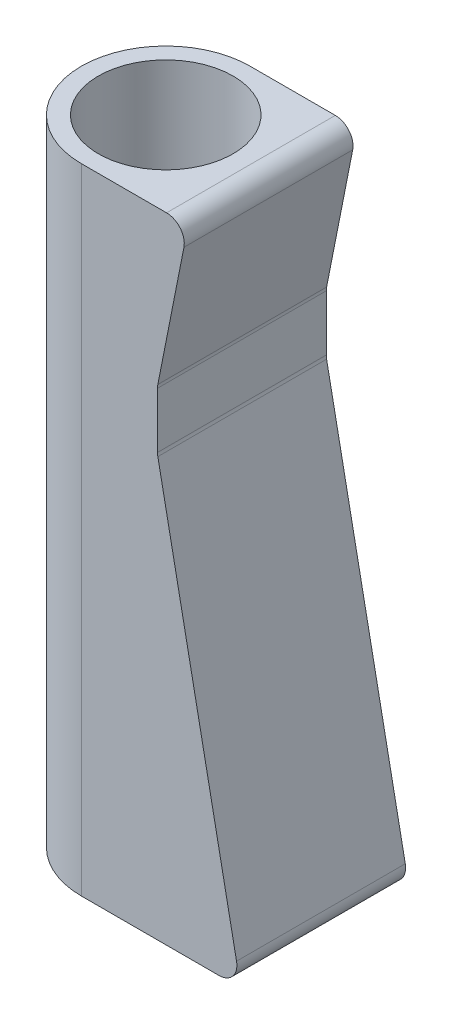
ISO-10303-21;
HEADER;
FILE_DESCRIPTION(('STEP AP214'),'2;1');
FILE_NAME('part.step','',(''),(''),'','','');
FILE_SCHEMA(('AUTOMOTIVE_DESIGN { 1 0 10303 214 1 1 1 1 }'));
ENDSEC;
DATA;
#1=APPLICATION_CONTEXT('core data for automotive mechanical design processes');
#2=APPLICATION_PROTOCOL_DEFINITION('international standard','automotive_design',2000,#1);
#3=PRODUCT_CONTEXT('',#1,'mechanical');
#4=PRODUCT('Part','Part','',(#3));
#5=PRODUCT_RELATED_PRODUCT_CATEGORY('part','',(#4));
#6=PRODUCT_DEFINITION_FORMATION('','',#4);
#7=PRODUCT_DEFINITION_CONTEXT('part definition',#1,'design');
#8=PRODUCT_DEFINITION('design','',#6,#7);
#9=PRODUCT_DEFINITION_SHAPE('','',#8);
#10=(LENGTH_UNIT() NAMED_UNIT(*) SI_UNIT(.MILLI.,.METRE.));
#11=(NAMED_UNIT(*) PLANE_ANGLE_UNIT() SI_UNIT($,.RADIAN.));
#12=(NAMED_UNIT(*) SI_UNIT($,.STERADIAN.) SOLID_ANGLE_UNIT());
#13=UNCERTAINTY_MEASURE_WITH_UNIT(LENGTH_MEASURE(1.E-05),#10,'distance_accuracy_value','');
#14=(GEOMETRIC_REPRESENTATION_CONTEXT(3) GLOBAL_UNCERTAINTY_ASSIGNED_CONTEXT((#13)) GLOBAL_UNIT_ASSIGNED_CONTEXT((#10,
#11,#12)) REPRESENTATION_CONTEXT('',''));
#15=CARTESIAN_POINT('',(0.,0.,0.));
#16=DIRECTION('',(0.,0.,1.));
#17=DIRECTION('',(1.,0.,0.));
#18=AXIS2_PLACEMENT_3D('',#15,#16,#17);
#19=CARTESIAN_POINT('',(0.,152.4,0.));
#20=DIRECTION('',(0.,-1.,0.));
#21=DIRECTION('',(0.,0.,-1.));
#22=AXIS2_PLACEMENT_3D('',#19,#20,#21);
#23=CYLINDRICAL_SURFACE('',#22,14.2875);
#24=DIRECTION('',(0.,1.,0.));
#25=VECTOR('',#24,1.);
#26=CARTESIAN_POINT('',(0.,0.,14.2875));
#27=LINE('',#26,#25);
#28=CARTESIAN_POINT('',(0.,0.,14.2875));
#29=VERTEX_POINT('',#28);
#30=CARTESIAN_POINT('',(0.,107.4,14.2875));
#31=VERTEX_POINT('',#30);
#32=EDGE_CURVE('E126',#29,#31,#27,.T.);
#33=ORIENTED_EDGE('',*,*,#32,.T.);
#34=CARTESIAN_POINT('',(0.,107.4,0.));
#35=DIRECTION('',(0.,-1.,0.));
#36=DIRECTION('',(0.,0.,-1.));
#37=AXIS2_PLACEMENT_3D('',#34,#35,#36);
#38=CIRCLE('',#37,14.2875);
#39=CARTESIAN_POINT('',(0.,107.4,-14.2875));
#40=VERTEX_POINT('',#39);
#41=EDGE_CURVE('E113',#31,#40,#38,.T.);
#42=ORIENTED_EDGE('',*,*,#41,.T.);
#43=DIRECTION('',(0.,1.,0.));
#44=VECTOR('',#43,1.);
#45=CARTESIAN_POINT('',(0.,0.,-14.2875));
#46=LINE('',#45,#44);
#47=CARTESIAN_POINT('',(0.,0.,-14.2875));
#48=VERTEX_POINT('',#47);
#49=EDGE_CURVE('E135',#48,#40,#46,.T.);
#50=ORIENTED_EDGE('',*,*,#49,.F.);
#51=CARTESIAN_POINT('',(0.,0.,0.));
#52=DIRECTION('',(0.,1.,0.));
#53=DIRECTION('',(0.,0.,1.));
#54=AXIS2_PLACEMENT_3D('',#51,#52,#53);
#55=CIRCLE('',#54,14.2875);
#56=EDGE_CURVE('E132',#48,#29,#55,.T.);
#57=ORIENTED_EDGE('',*,*,#56,.T.);
#58=EDGE_LOOP('',(#33,#42,#50,#57));
#59=FACE_BOUND('',#58,.T.);
#60=ADVANCED_FACE('F38',(#59),#23,.T.);
#61=CARTESIAN_POINT('',(0.,0.,0.));
#62=DIRECTION('',(0.,1.,0.));
#63=DIRECTION('',(0.,0.,1.));
#64=AXIS2_PLACEMENT_3D('',#61,#62,#63);
#65=PLANE('',#64);
#66=DIRECTION('',(-1.,0.,0.));
#67=VECTOR('',#66,1.);
#68=CARTESIAN_POINT('',(26.9875,0.,-14.2875));
#69=LINE('',#68,#67);
#70=CARTESIAN_POINT('',(23.3356277952367,0.,-14.2875));
#71=VERTEX_POINT('',#70);
#72=EDGE_CURVE('E221',#71,#48,#69,.T.);
#73=ORIENTED_EDGE('',*,*,#72,.F.);
#74=DIRECTION('',(0.,0.,-1.));
#75=VECTOR('',#74,1.);
#76=CARTESIAN_POINT('',(23.3356277952367,0.,0.));
#77=LINE('',#76,#75);
#78=CARTESIAN_POINT('',(23.3356277952367,0.,14.2875));
#79=VERTEX_POINT('',#78);
#80=EDGE_CURVE('E173',#71,#79,#77,.F.);
#81=ORIENTED_EDGE('',*,*,#80,.T.);
#82=DIRECTION('',(1.,0.,0.));
#83=VECTOR('',#82,1.);
#84=CARTESIAN_POINT('',(14.2875,0.,14.2875));
#85=LINE('',#84,#83);
#86=EDGE_CURVE('E141',#29,#79,#85,.T.);
#87=ORIENTED_EDGE('',*,*,#86,.F.);
#88=ORIENTED_EDGE('',*,*,#56,.F.);
#89=EDGE_LOOP('',(#73,#81,#87,#88));
#90=FACE_BOUND('',#89,.T.);
#91=CARTESIAN_POINT('',(0.,0.,0.));
#92=DIRECTION('',(0.,1.,0.));
#93=DIRECTION('',(0.,0.,1.));
#94=AXIS2_PLACEMENT_3D('',#91,#92,#93);
#95=CIRCLE('',#94,11.4125);
#96=CARTESIAN_POINT('',(0.,0.,11.4125));
#97=VERTEX_POINT('',#96);
#98=EDGE_CURVE('E134',#97,#97,#95,.T.);
#99=ORIENTED_EDGE('',*,*,#98,.T.);
#100=EDGE_LOOP('',(#99));
#101=FACE_BOUND('',#100,.T.);
#102=ADVANCED_FACE('F258',(#90,#101),#65,.F.);
#103=CARTESIAN_POINT('',(0.,152.4,0.));
#104=DIRECTION('',(0.,-1.,0.));
#105=DIRECTION('',(0.,0.,-1.));
#106=AXIS2_PLACEMENT_3D('',#103,#104,#105);
#107=CYLINDRICAL_SURFACE('',#106,11.4125);
#108=CARTESIAN_POINT('',(0.,107.4,0.));
#109=DIRECTION('',(0.,-1.,0.));
#110=DIRECTION('',(0.,0.,-1.));
#111=AXIS2_PLACEMENT_3D('',#108,#109,#110);
#112=CIRCLE('',#111,11.4125);
#113=CARTESIAN_POINT('',(0.,107.4,-11.4125));
#114=VERTEX_POINT('',#113);
#115=EDGE_CURVE('E122',#114,#114,#112,.T.);
#116=ORIENTED_EDGE('',*,*,#115,.F.);
#117=EDGE_LOOP('',(#116));
#118=FACE_BOUND('',#117,.T.);
#119=ORIENTED_EDGE('',*,*,#98,.F.);
#120=EDGE_LOOP('',(#119));
#121=FACE_BOUND('',#120,.T.);
#122=ADVANCED_FACE('F261',(#118,#121),#107,.F.);
#123=CARTESIAN_POINT('',(14.2875,0.,14.2875));
#124=DIRECTION('',(0.,0.,1.));
#125=DIRECTION('',(1.,0.,0.));
#126=AXIS2_PLACEMENT_3D('',#123,#124,#125);
#127=PLANE('',#126);
#128=DIRECTION('',(-0.194132229628374,-0.980975370444904,0.));
#129=VECTOR('',#128,1.);
#130=CARTESIAN_POINT('',(12.8972229492404,81.2,14.2875));
#131=LINE('',#130,#129);
#132=CARTESIAN_POINT('',(17.373182175052,103.817603311115,14.2875));
#133=VERTEX_POINT('',#132);
#134=CARTESIAN_POINT('',(12.9542968379057,81.4884017722526,14.2875));
#135=VERTEX_POINT('',#134);
#136=EDGE_CURVE('E199',#133,#135,#131,.T.);
#137=ORIENTED_EDGE('',*,*,#136,.F.);
#138=CARTESIAN_POINT('',(14.4302560637173,104.4,14.2875));
#139=DIRECTION('',(0.,0.,1.));
#140=DIRECTION('',(1.,0.,0.));
#141=AXIS2_PLACEMENT_3D('',#138,#139,#140);
#142=CIRCLE('',#141,3.);
#143=CARTESIAN_POINT('',(14.4302560637173,107.4,14.2875));
#144=VERTEX_POINT('',#143);
#145=EDGE_CURVE('E61',#133,#144,#142,.T.);
#146=ORIENTED_EDGE('',*,*,#145,.T.);
#147=DIRECTION('',(1.,0.,0.));
#148=VECTOR('',#147,1.);
#149=CARTESIAN_POINT('',(34.7125,107.4,14.2875));
#150=LINE('',#149,#148);
#151=EDGE_CURVE('E115',#31,#144,#150,.T.);
#152=ORIENTED_EDGE('',*,*,#151,.F.);
#153=ORIENTED_EDGE('',*,*,#32,.F.);
#154=ORIENTED_EDGE('',*,*,#86,.T.);
#155=CARTESIAN_POINT('',(23.3356277952367,3.,14.2875));
#156=DIRECTION('',(0.,0.,1.));
#157=DIRECTION('',(1.,0.,0.));
#158=AXIS2_PLACEMENT_3D('',#155,#156,#157);
#159=CIRCLE('',#158,3.);
#160=CARTESIAN_POINT('',(26.2785539065714,3.58239668888512,14.2875));
#161=VERTEX_POINT('',#160);
#162=EDGE_CURVE('E155',#79,#161,#159,.T.);
#163=ORIENTED_EDGE('',*,*,#162,.T.);
#164=DIRECTION('',(0.194132229628374,-0.980975370444904,0.));
#165=VECTOR('',#164,1.);
#166=CARTESIAN_POINT('',(26.9875,0.,14.2875));
#167=LINE('',#166,#165);
#168=CARTESIAN_POINT('',(12.9542968379057,70.9115982277474,14.2875));
#169=VERTEX_POINT('',#168);
#170=EDGE_CURVE('E211',#169,#161,#167,.T.);
#171=ORIENTED_EDGE('',*,*,#170,.F.);
#172=CARTESIAN_POINT('',(15.8972229492404,71.4939949166326,14.2875));
#173=DIRECTION('',(0.,0.,1.));
#174=DIRECTION('',(1.,0.,0.));
#175=AXIS2_PLACEMENT_3D('',#172,#173,#174);
#176=CIRCLE('',#175,3.);
#177=CARTESIAN_POINT('',(12.8972229492404,71.4939949166326,14.2875));
#178=VERTEX_POINT('',#177);
#179=EDGE_CURVE('E183',#169,#178,#176,.F.);
#180=ORIENTED_EDGE('',*,*,#179,.T.);
#181=DIRECTION('',(0.,-1.,0.));
#182=VECTOR('',#181,1.);
#183=CARTESIAN_POINT('',(12.8972229492404,71.2,14.2875));
#184=LINE('',#183,#182);
#185=CARTESIAN_POINT('',(12.8972229492404,80.9060050833674,14.2875));
#186=VERTEX_POINT('',#185);
#187=EDGE_CURVE('E206',#186,#178,#184,.T.);
#188=ORIENTED_EDGE('',*,*,#187,.F.);
#189=CARTESIAN_POINT('',(15.8972229492404,80.9060050833674,14.2875));
#190=DIRECTION('',(0.,0.,1.));
#191=DIRECTION('',(1.,0.,0.));
#192=AXIS2_PLACEMENT_3D('',#189,#190,#191);
#193=CIRCLE('',#192,3.);
#194=EDGE_CURVE('E176',#186,#135,#193,.F.);
#195=ORIENTED_EDGE('',*,*,#194,.T.);
#196=EDGE_LOOP('',(#137,#146,#152,#153,#154,#163,#171,#180,#188,#195));
#197=FACE_BOUND('',#196,.T.);
#198=ADVANCED_FACE('F124',(#197),#127,.T.);
#199=CARTESIAN_POINT('',(14.2875,0.,-14.2875));
#200=DIRECTION('',(0.,0.,-1.));
#201=DIRECTION('',(-1.,0.,0.));
#202=AXIS2_PLACEMENT_3D('',#199,#200,#201);
#203=PLANE('',#202);
#204=DIRECTION('',(-1.,0.,0.));
#205=VECTOR('',#204,1.);
#206=CARTESIAN_POINT('',(14.2875,107.4,-14.2875));
#207=LINE('',#206,#205);
#208=CARTESIAN_POINT('',(14.4302560637173,107.4,-14.2875));
#209=VERTEX_POINT('',#208);
#210=EDGE_CURVE('E116',#209,#40,#207,.T.);
#211=ORIENTED_EDGE('',*,*,#210,.F.);
#212=CARTESIAN_POINT('',(14.4302560637173,104.4,-14.2875));
#213=DIRECTION('',(0.,0.,-1.));
#214=DIRECTION('',(-1.,0.,0.));
#215=AXIS2_PLACEMENT_3D('',#212,#213,#214);
#216=CIRCLE('',#215,3.);
#217=CARTESIAN_POINT('',(17.373182175052,103.817603311115,-14.2875));
#218=VERTEX_POINT('',#217);
#219=EDGE_CURVE('E11',#209,#218,#216,.T.);
#220=ORIENTED_EDGE('',*,*,#219,.T.);
#221=DIRECTION('',(-0.194132229628374,-0.980975370444904,0.));
#222=VECTOR('',#221,1.);
#223=CARTESIAN_POINT('',(12.8972229492404,81.2,-14.2875));
#224=LINE('',#223,#222);
#225=CARTESIAN_POINT('',(12.9542968379057,81.4884017722526,-14.2875));
#226=VERTEX_POINT('',#225);
#227=EDGE_CURVE('E200',#218,#226,#224,.T.);
#228=ORIENTED_EDGE('',*,*,#227,.T.);
#229=CARTESIAN_POINT('',(15.8972229492404,80.9060050833674,-14.2875));
#230=DIRECTION('',(0.,0.,-1.));
#231=DIRECTION('',(-1.,0.,0.));
#232=AXIS2_PLACEMENT_3D('',#229,#230,#231);
#233=CIRCLE('',#232,3.);
#234=CARTESIAN_POINT('',(12.8972229492404,80.9060050833674,-14.2875));
#235=VERTEX_POINT('',#234);
#236=EDGE_CURVE('E180',#226,#235,#233,.F.);
#237=ORIENTED_EDGE('',*,*,#236,.T.);
#238=DIRECTION('',(0.,-1.,0.));
#239=VECTOR('',#238,1.);
#240=CARTESIAN_POINT('',(12.8972229492404,71.2,-14.2875));
#241=LINE('',#240,#239);
#242=CARTESIAN_POINT('',(12.8972229492404,71.4939949166326,-14.2875));
#243=VERTEX_POINT('',#242);
#244=EDGE_CURVE('E228',#235,#243,#241,.T.);
#245=ORIENTED_EDGE('',*,*,#244,.T.);
#246=CARTESIAN_POINT('',(15.8972229492404,71.4939949166326,-14.2875));
#247=DIRECTION('',(0.,0.,-1.));
#248=DIRECTION('',(-1.,0.,0.));
#249=AXIS2_PLACEMENT_3D('',#246,#247,#248);
#250=CIRCLE('',#249,3.);
#251=CARTESIAN_POINT('',(12.9542968379057,70.9115982277474,-14.2875));
#252=VERTEX_POINT('',#251);
#253=EDGE_CURVE('E186',#243,#252,#250,.F.);
#254=ORIENTED_EDGE('',*,*,#253,.T.);
#255=DIRECTION('',(0.194132229628374,-0.980975370444904,0.));
#256=VECTOR('',#255,1.);
#257=CARTESIAN_POINT('',(26.9875,0.,-14.2875));
#258=LINE('',#257,#256);
#259=CARTESIAN_POINT('',(26.2785539065714,3.58239668888512,-14.2875));
#260=VERTEX_POINT('',#259);
#261=EDGE_CURVE('E216',#252,#260,#258,.T.);
#262=ORIENTED_EDGE('',*,*,#261,.T.);
#263=CARTESIAN_POINT('',(23.3356277952367,3.,-14.2875));
#264=DIRECTION('',(0.,0.,-1.));
#265=DIRECTION('',(-1.,0.,0.));
#266=AXIS2_PLACEMENT_3D('',#263,#264,#265);
#267=CIRCLE('',#266,3.);
#268=EDGE_CURVE('E148',#260,#71,#267,.T.);
#269=ORIENTED_EDGE('',*,*,#268,.T.);
#270=ORIENTED_EDGE('',*,*,#72,.T.);
#271=ORIENTED_EDGE('',*,*,#49,.T.);
#272=EDGE_LOOP('',(#211,#220,#228,#237,#245,#254,#262,#269,#270,#271));
#273=FACE_BOUND('',#272,.T.);
#274=ADVANCED_FACE('F238',(#273),#203,.T.);
#275=CARTESIAN_POINT('',(26.9875,0.,-14.2875));
#276=DIRECTION('',(-0.980975370444904,-0.194132229628374,0.));
#277=DIRECTION('',(0.194132229628374,-0.980975370444904,0.));
#278=AXIS2_PLACEMENT_3D('',#275,#276,#277);
#279=PLANE('',#278);
#280=ORIENTED_EDGE('',*,*,#261,.F.);
#281=DIRECTION('',(0.,0.,1.));
#282=VECTOR('',#281,1.);
#283=CARTESIAN_POINT('',(12.9542968379057,70.9115982277474,14.2875));
#284=LINE('',#283,#282);
#285=EDGE_CURVE('E169',#252,#169,#284,.T.);
#286=ORIENTED_EDGE('',*,*,#285,.T.);
#287=ORIENTED_EDGE('',*,*,#170,.T.);
#288=DIRECTION('',(0.,0.,-1.));
#289=VECTOR('',#288,1.);
#290=CARTESIAN_POINT('',(26.2785539065714,3.58239668888512,-14.2875));
#291=LINE('',#290,#289);
#292=EDGE_CURVE('E165',#161,#260,#291,.T.);
#293=ORIENTED_EDGE('',*,*,#292,.T.);
#294=EDGE_LOOP('',(#280,#286,#287,#293));
#295=FACE_BOUND('',#294,.T.);
#296=ADVANCED_FACE('F251',(#295),#279,.F.);
#297=CARTESIAN_POINT('',(12.8972229492404,71.2,-14.2875));
#298=DIRECTION('',(-1.,0.,0.));
#299=DIRECTION('',(0.,0.,1.));
#300=AXIS2_PLACEMENT_3D('',#297,#298,#299);
#301=PLANE('',#300);
#302=ORIENTED_EDGE('',*,*,#244,.F.);
#303=DIRECTION('',(0.,0.,1.));
#304=VECTOR('',#303,1.);
#305=CARTESIAN_POINT('',(12.8972229492404,80.9060050833674,14.2875));
#306=LINE('',#305,#304);
#307=EDGE_CURVE('E161',#235,#186,#306,.T.);
#308=ORIENTED_EDGE('',*,*,#307,.T.);
#309=ORIENTED_EDGE('',*,*,#187,.T.);
#310=DIRECTION('',(0.,0.,1.));
#311=VECTOR('',#310,1.);
#312=CARTESIAN_POINT('',(12.8972229492404,71.4939949166326,-14.2875));
#313=LINE('',#312,#311);
#314=EDGE_CURVE('E158',#178,#243,#313,.F.);
#315=ORIENTED_EDGE('',*,*,#314,.T.);
#316=EDGE_LOOP('',(#302,#308,#309,#315));
#317=FACE_BOUND('',#316,.T.);
#318=ADVANCED_FACE('F244',(#317),#301,.F.);
#319=CARTESIAN_POINT('',(12.8972229492404,81.2,-14.2875));
#320=DIRECTION('',(-0.980975370444904,0.194132229628374,0.));
#321=DIRECTION('',(-0.194132229628374,-0.980975370444904,0.));
#322=AXIS2_PLACEMENT_3D('',#319,#320,#321);
#323=PLANE('',#322);
#324=ORIENTED_EDGE('',*,*,#227,.F.);
#325=DIRECTION('',(0.,0.,1.));
#326=VECTOR('',#325,1.);
#327=CARTESIAN_POINT('',(17.373182175052,103.817603311115,-14.2875));
#328=LINE('',#327,#326);
#329=EDGE_CURVE('E189',#218,#133,#328,.T.);
#330=ORIENTED_EDGE('',*,*,#329,.T.);
#331=ORIENTED_EDGE('',*,*,#136,.T.);
#332=DIRECTION('',(0.,0.,1.));
#333=VECTOR('',#332,1.);
#334=CARTESIAN_POINT('',(12.9542968379057,81.4884017722526,-14.2875));
#335=LINE('',#334,#333);
#336=EDGE_CURVE('E151',#135,#226,#335,.F.);
#337=ORIENTED_EDGE('',*,*,#336,.T.);
#338=EDGE_LOOP('',(#324,#330,#331,#337));
#339=FACE_BOUND('',#338,.T.);
#340=ADVANCED_FACE('F198',(#339),#323,.F.);
#341=CARTESIAN_POINT('',(15.8972229492404,80.9060050833674,-14.2875));
#342=DIRECTION('',(0.,0.,-1.));
#343=DIRECTION('',(-1.,0.,0.));
#344=AXIS2_PLACEMENT_3D('',#341,#342,#343);
#345=CYLINDRICAL_SURFACE('',#344,3.);
#346=ORIENTED_EDGE('',*,*,#236,.F.);
#347=ORIENTED_EDGE('',*,*,#336,.F.);
#348=ORIENTED_EDGE('',*,*,#194,.F.);
#349=ORIENTED_EDGE('',*,*,#307,.F.);
#350=EDGE_LOOP('',(#346,#347,#348,#349));
#351=FACE_BOUND('',#350,.T.);
#352=ADVANCED_FACE('F242',(#351),#345,.F.);
#353=CARTESIAN_POINT('',(15.8972229492404,71.4939949166326,-14.2875));
#354=DIRECTION('',(0.,0.,-1.));
#355=DIRECTION('',(-1.,0.,0.));
#356=AXIS2_PLACEMENT_3D('',#353,#354,#355);
#357=CYLINDRICAL_SURFACE('',#356,3.);
#358=ORIENTED_EDGE('',*,*,#253,.F.);
#359=ORIENTED_EDGE('',*,*,#314,.F.);
#360=ORIENTED_EDGE('',*,*,#179,.F.);
#361=ORIENTED_EDGE('',*,*,#285,.F.);
#362=EDGE_LOOP('',(#358,#359,#360,#361));
#363=FACE_BOUND('',#362,.T.);
#364=ADVANCED_FACE('F249',(#363),#357,.F.);
#365=CARTESIAN_POINT('',(23.3356277952367,3.,-14.2875));
#366=DIRECTION('',(0.,0.,-1.));
#367=DIRECTION('',(-1.,0.,0.));
#368=AXIS2_PLACEMENT_3D('',#365,#366,#367);
#369=CYLINDRICAL_SURFACE('',#368,3.);
#370=ORIENTED_EDGE('',*,*,#162,.F.);
#371=ORIENTED_EDGE('',*,*,#80,.F.);
#372=ORIENTED_EDGE('',*,*,#268,.F.);
#373=ORIENTED_EDGE('',*,*,#292,.F.);
#374=EDGE_LOOP('',(#370,#371,#372,#373));
#375=FACE_BOUND('',#374,.T.);
#376=ADVANCED_FACE('F255',(#375),#369,.T.);
#377=CARTESIAN_POINT('',(34.7125,107.4,-67.7125));
#378=DIRECTION('',(0.,-1.,0.));
#379=DIRECTION('',(0.,0.,-1.));
#380=AXIS2_PLACEMENT_3D('',#377,#378,#379);
#381=PLANE('',#380);
#382=ORIENTED_EDGE('',*,*,#115,.T.);
#383=EDGE_LOOP('',(#382));
#384=FACE_BOUND('',#383,.T.);
#385=ORIENTED_EDGE('',*,*,#151,.T.);
#386=DIRECTION('',(0.,0.,1.));
#387=VECTOR('',#386,1.);
#388=CARTESIAN_POINT('',(14.4302560637173,107.4,-67.7125));
#389=LINE('',#388,#387);
#390=EDGE_CURVE('E47',#144,#209,#389,.F.);
#391=ORIENTED_EDGE('',*,*,#390,.T.);
#392=ORIENTED_EDGE('',*,*,#210,.T.);
#393=ORIENTED_EDGE('',*,*,#41,.F.);
#394=EDGE_LOOP('',(#385,#391,#392,#393));
#395=FACE_BOUND('',#394,.T.);
#396=ADVANCED_FACE('F114',(#384,#395),#381,.F.);
#397=CARTESIAN_POINT('',(14.4302560637173,104.4,-14.2875));
#398=DIRECTION('',(0.,0.,1.));
#399=DIRECTION('',(1.,0.,0.));
#400=AXIS2_PLACEMENT_3D('',#397,#398,#399);
#401=CYLINDRICAL_SURFACE('',#400,3.);
#402=ORIENTED_EDGE('',*,*,#219,.F.);
#403=ORIENTED_EDGE('',*,*,#390,.F.);
#404=ORIENTED_EDGE('',*,*,#145,.F.);
#405=ORIENTED_EDGE('',*,*,#329,.F.);
#406=EDGE_LOOP('',(#402,#403,#404,#405));
#407=FACE_BOUND('',#406,.T.);
#408=ADVANCED_FACE('F40',(#407),#401,.T.);
#409=CLOSED_SHELL('',(#60,#102,#122,#198,#274,#296,#318,#340,#352,#364,#376,#396,#408));
#410=MANIFOLD_SOLID_BREP('B2',#409);
#411=ADVANCED_BREP_SHAPE_REPRESENTATION('',(#18,#410),#14);
#412=SHAPE_DEFINITION_REPRESENTATION(#9,#411);
ENDSEC;
END-ISO-10303-21;
